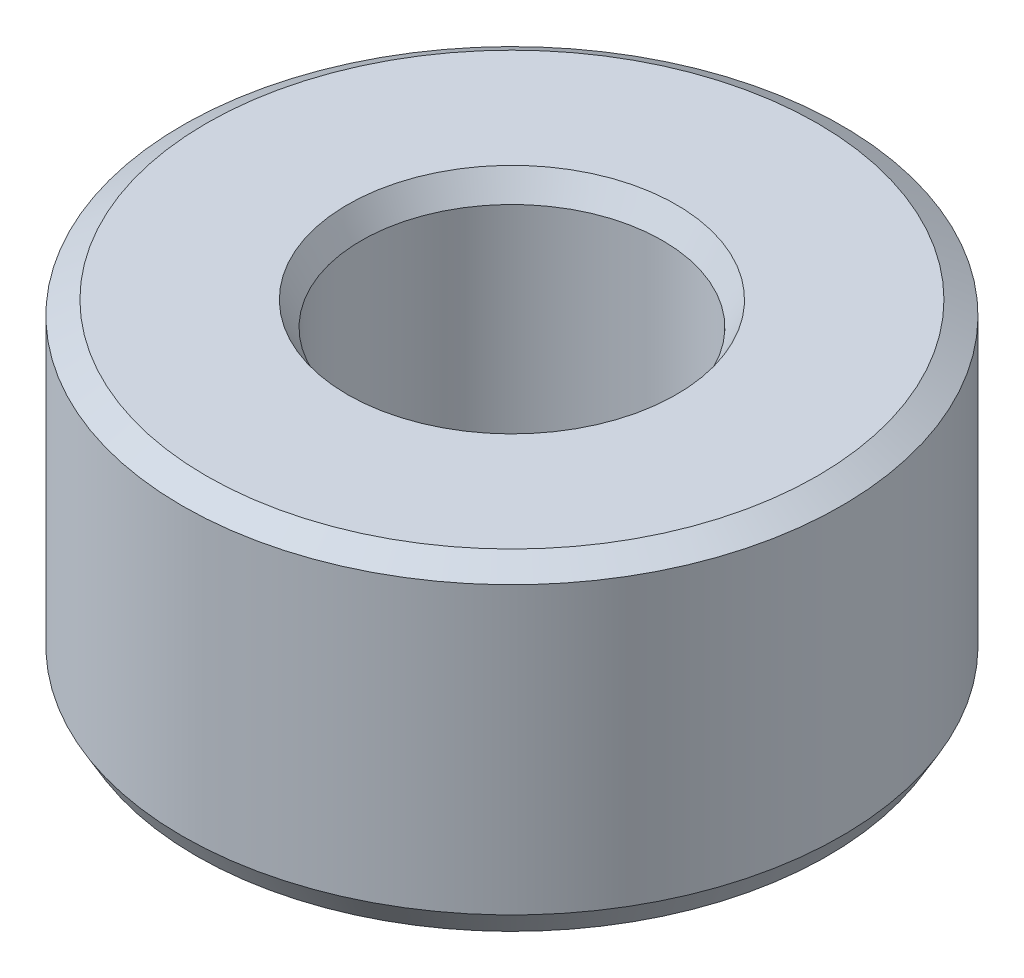
ISO-10303-21;
HEADER;
FILE_DESCRIPTION(('STEP AP214'),'2;1');
FILE_NAME('part.step','',(''),(''),'','','');
FILE_SCHEMA(('AUTOMOTIVE_DESIGN { 1 0 10303 214 1 1 1 1 }'));
ENDSEC;
DATA;
#1=APPLICATION_CONTEXT('core data for automotive mechanical design processes');
#2=APPLICATION_PROTOCOL_DEFINITION('international standard','automotive_design',2000,#1);
#3=PRODUCT_CONTEXT('',#1,'mechanical');
#4=PRODUCT('Part','Part','',(#3));
#5=PRODUCT_RELATED_PRODUCT_CATEGORY('part','',(#4));
#6=PRODUCT_DEFINITION_FORMATION('','',#4);
#7=PRODUCT_DEFINITION_CONTEXT('part definition',#1,'design');
#8=PRODUCT_DEFINITION('design','',#6,#7);
#9=PRODUCT_DEFINITION_SHAPE('','',#8);
#10=(LENGTH_UNIT() NAMED_UNIT(*) SI_UNIT(.MILLI.,.METRE.));
#11=(NAMED_UNIT(*) PLANE_ANGLE_UNIT() SI_UNIT($,.RADIAN.));
#12=(NAMED_UNIT(*) SI_UNIT($,.STERADIAN.) SOLID_ANGLE_UNIT());
#13=UNCERTAINTY_MEASURE_WITH_UNIT(LENGTH_MEASURE(1.E-05),#10,'distance_accuracy_value','');
#14=(GEOMETRIC_REPRESENTATION_CONTEXT(3) GLOBAL_UNCERTAINTY_ASSIGNED_CONTEXT((#13)) GLOBAL_UNIT_ASSIGNED_CONTEXT((#10,
#11,#12)) REPRESENTATION_CONTEXT('',''));
#15=CARTESIAN_POINT('',(0.,0.,0.));
#16=DIRECTION('',(0.,0.,1.));
#17=DIRECTION('',(1.,0.,0.));
#18=AXIS2_PLACEMENT_3D('',#15,#16,#17);
#19=CARTESIAN_POINT('',(0.,9.82928512736957,0.));
#20=DIRECTION('',(0.,-1.,0.));
#21=DIRECTION('',(0.,0.,-1.));
#22=AXIS2_PLACEMENT_3D('',#19,#20,#21);
#23=CYLINDRICAL_SURFACE('',#22,10.);
#24=CARTESIAN_POINT('',(0.,0.730427583920078,0.));
#25=DIRECTION('',(0.,1.,0.));
#26=DIRECTION('',(0.,0.,1.));
#27=AXIS2_PLACEMENT_3D('',#24,#25,#26);
#28=CIRCLE('',#27,10.);
#29=CARTESIAN_POINT('',(0.,0.730427583920078,10.));
#30=VERTEX_POINT('',#29);
#31=EDGE_CURVE('E10',#30,#30,#28,.T.);
#32=ORIENTED_EDGE('',*,*,#31,.T.);
#33=EDGE_LOOP('',(#32));
#34=FACE_BOUND('',#33,.T.);
#35=CARTESIAN_POINT('',(0.,9.40757256516978,0.));
#36=DIRECTION('',(0.,1.,0.));
#37=DIRECTION('',(0.,0.,1.));
#38=AXIS2_PLACEMENT_3D('',#35,#36,#37);
#39=CIRCLE('',#38,10.);
#40=CARTESIAN_POINT('',(0.,9.40757256516978,10.));
#41=VERTEX_POINT('',#40);
#42=EDGE_CURVE('E50',#41,#41,#39,.F.);
#43=ORIENTED_EDGE('',*,*,#42,.T.);
#44=EDGE_LOOP('',(#43));
#45=FACE_BOUND('',#44,.T.);
#46=ADVANCED_FACE('F39',(#34,#45),#23,.T.);
#47=CARTESIAN_POINT('',(0.,9.82928512736957,0.));
#48=DIRECTION('',(0.,1.,0.));
#49=DIRECTION('',(0.,0.,1.));
#50=AXIS2_PLACEMENT_3D('',#47,#48,#49);
#51=PLANE('',#50);
#52=CARTESIAN_POINT('',(0.,9.82928512736957,0.));
#53=DIRECTION('',(0.,1.,0.));
#54=DIRECTION('',(0.,0.,1.));
#55=AXIS2_PLACEMENT_3D('',#52,#53,#54);
#56=CIRCLE('',#55,4.99111512470064);
#57=CARTESIAN_POINT('',(0.,9.82928512736957,4.99111512470064));
#58=VERTEX_POINT('',#57);
#59=EDGE_CURVE('E58',#58,#58,#56,.F.);
#60=ORIENTED_EDGE('',*,*,#59,.T.);
#61=EDGE_LOOP('',(#60));
#62=FACE_BOUND('',#61,.T.);
#63=CARTESIAN_POINT('',(0.,9.82928512736957,0.));
#64=DIRECTION('',(0.,1.,0.));
#65=DIRECTION('',(0.,0.,1.));
#66=AXIS2_PLACEMENT_3D('',#63,#64,#65);
#67=CIRCLE('',#66,9.26957241607992);
#68=CARTESIAN_POINT('',(0.,9.82928512736957,9.26957241607992));
#69=VERTEX_POINT('',#68);
#70=EDGE_CURVE('E61',#69,#69,#67,.T.);
#71=ORIENTED_EDGE('',*,*,#70,.T.);
#72=EDGE_LOOP('',(#71));
#73=FACE_BOUND('',#72,.T.);
#74=ADVANCED_FACE('F88',(#62,#73),#51,.T.);
#75=CARTESIAN_POINT('',(0.,0.,0.));
#76=DIRECTION('',(0.,1.,0.));
#77=DIRECTION('',(0.,0.,1.));
#78=AXIS2_PLACEMENT_3D('',#75,#76,#77);
#79=PLANE('',#78);
#80=CARTESIAN_POINT('',(0.,0.,0.));
#81=DIRECTION('',(0.,1.,0.));
#82=DIRECTION('',(0.,0.,1.));
#83=AXIS2_PLACEMENT_3D('',#80,#81,#82);
#84=CIRCLE('',#83,5.29983014642093);
#85=CARTESIAN_POINT('',(0.,0.,5.29983014642093));
#86=VERTEX_POINT('',#85);
#87=EDGE_CURVE('E51',#86,#86,#84,.T.);
#88=ORIENTED_EDGE('',*,*,#87,.T.);
#89=EDGE_LOOP('',(#88));
#90=FACE_BOUND('',#89,.T.);
#91=CARTESIAN_POINT('',(0.,0.,0.));
#92=DIRECTION('',(0.,1.,0.));
#93=DIRECTION('',(0.,0.,1.));
#94=AXIS2_PLACEMENT_3D('',#91,#92,#93);
#95=CIRCLE('',#94,9.57828743780021);
#96=CARTESIAN_POINT('',(0.,0.,9.57828743780021));
#97=VERTEX_POINT('',#96);
#98=EDGE_CURVE('E54',#97,#97,#95,.F.);
#99=ORIENTED_EDGE('',*,*,#98,.T.);
#100=EDGE_LOOP('',(#99));
#101=FACE_BOUND('',#100,.T.);
#102=ADVANCED_FACE('F83',(#90,#101),#79,.F.);
#103=CARTESIAN_POINT('',(0.,9.82928512736957,0.));
#104=DIRECTION('',(0.,-1.,0.));
#105=DIRECTION('',(0.,0.,-1.));
#106=AXIS2_PLACEMENT_3D('',#103,#104,#105);
#107=CYLINDRICAL_SURFACE('',#106,4.56940256250085);
#108=CARTESIAN_POINT('',(0.,9.0988575434495,0.));
#109=DIRECTION('',(0.,1.,0.));
#110=DIRECTION('',(0.,0.,1.));
#111=AXIS2_PLACEMENT_3D('',#108,#109,#110);
#112=CIRCLE('',#111,4.56940256250085);
#113=CARTESIAN_POINT('',(0.,9.0988575434495,4.56940256250085));
#114=VERTEX_POINT('',#113);
#115=EDGE_CURVE('E67',#114,#114,#112,.T.);
#116=ORIENTED_EDGE('',*,*,#115,.T.);
#117=EDGE_LOOP('',(#116));
#118=FACE_BOUND('',#117,.T.);
#119=CARTESIAN_POINT('',(0.,0.421712562199793,0.));
#120=DIRECTION('',(0.,1.,0.));
#121=DIRECTION('',(0.,0.,1.));
#122=AXIS2_PLACEMENT_3D('',#119,#120,#121);
#123=CIRCLE('',#122,4.56940256250085);
#124=CARTESIAN_POINT('',(0.,0.421712562199793,4.56940256250085));
#125=VERTEX_POINT('',#124);
#126=EDGE_CURVE('E69',#125,#125,#123,.F.);
#127=ORIENTED_EDGE('',*,*,#126,.T.);
#128=EDGE_LOOP('',(#127));
#129=FACE_BOUND('',#128,.T.);
#130=ADVANCED_FACE('F71',(#118,#129),#107,.F.);
#131=CARTESIAN_POINT('',(0.,9.0988575434495,0.));
#132=DIRECTION('',(0.,1.,0.));
#133=DIRECTION('',(0.,0.,1.));
#134=AXIS2_PLACEMENT_3D('',#131,#132,#133);
#135=CONICAL_SURFACE('',#134,4.56940256250085,0.523598775598302);
#136=CARTESIAN_POINT('',(0.,9.82928512736957,4.99111512470064));
#137=CARTESIAN_POINT('',(0.,9.82167650670374,4.98672228551106));
#138=CARTESIAN_POINT('',(0.,9.81406788603791,4.98232944632147));
#139=CARTESIAN_POINT('',(0.,9.79885064470624,4.97354376794231));
#140=CARTESIAN_POINT('',(0.,9.7912420240404,4.96915092875273));
#141=CARTESIAN_POINT('',(0.,9.77602478270874,4.96036525037357));
#142=CARTESIAN_POINT('',(0.,9.7684161620429,4.95597241118399));
#143=CARTESIAN_POINT('',(0.,9.75319892071123,4.94718673280483));
#144=CARTESIAN_POINT('',(0.,9.7455903000454,4.94279389361524));
#145=CARTESIAN_POINT('',(0.,9.73037305871373,4.93400821523608));
#146=CARTESIAN_POINT('',(0.,9.7227644380479,4.9296153760465));
#147=CARTESIAN_POINT('',(0.,9.70754719671623,4.92082969766734));
#148=CARTESIAN_POINT('',(0.,9.69993857605039,4.91643685847776));
#149=CARTESIAN_POINT('',(0.,9.68472133471873,4.9076511800986));
#150=CARTESIAN_POINT('',(0.,9.67711271405289,4.90325834090901));
#151=CARTESIAN_POINT('',(0.,9.66189547272122,4.89447266252985));
#152=CARTESIAN_POINT('',(0.,9.65428685205539,4.89007982334027));
#153=CARTESIAN_POINT('',(0.,9.63906961072372,4.88129414496111));
#154=CARTESIAN_POINT('',(0.,9.63146099005789,4.87690130577153));
#155=CARTESIAN_POINT('',(0.,9.61624374872622,4.86811562739237));
#156=CARTESIAN_POINT('',(0.,9.60863512806039,4.86372278820278));
#157=CARTESIAN_POINT('',(0.,9.59341788672872,4.85493710982362));
#158=CARTESIAN_POINT('',(0.,9.58580926606288,4.85054427063404));
#159=CARTESIAN_POINT('',(0.,9.57059202473121,4.84175859225488));
#160=CARTESIAN_POINT('',(0.,9.56298340406538,4.8373657530653));
#161=CARTESIAN_POINT('',(0.,9.54776616273371,4.82858007468614));
#162=CARTESIAN_POINT('',(0.,9.54015754206788,4.82418723549655));
#163=CARTESIAN_POINT('',(0.,9.52494030073621,4.81540155711739));
#164=CARTESIAN_POINT('',(0.,9.51733168007038,4.81100871792781));
#165=CARTESIAN_POINT('',(0.,9.50211443873871,4.80222303954865));
#166=CARTESIAN_POINT('',(0.,9.49450581807287,4.79783020035907));
#167=CARTESIAN_POINT('',(0.,9.4792885767412,4.78904452197991));
#168=CARTESIAN_POINT('',(0.,9.47167995607537,4.78465168279032));
#169=CARTESIAN_POINT('',(0.,9.4564627147437,4.77586600441116));
#170=CARTESIAN_POINT('',(0.,9.44885409407787,4.77147316522158));
#171=CARTESIAN_POINT('',(0.,9.4336368527462,4.76268748684242));
#172=CARTESIAN_POINT('',(0.,9.42602823208036,4.75829464765284));
#173=CARTESIAN_POINT('',(0.,9.4108109907487,4.74950896927368));
#174=CARTESIAN_POINT('',(0.,9.40320237008286,4.74511613008409));
#175=CARTESIAN_POINT('',(0.,9.3879851287512,4.73633045170493));
#176=CARTESIAN_POINT('',(0.,9.38037650808536,4.73193761251535));
#177=CARTESIAN_POINT('',(0.,9.36515926675369,4.72315193413619));
#178=CARTESIAN_POINT('',(0.,9.35755064608786,4.71875909494661));
#179=CARTESIAN_POINT('',(0.,9.34233340475619,4.70997341656745));
#180=CARTESIAN_POINT('',(0.,9.33472478409036,4.70558057737786));
#181=CARTESIAN_POINT('',(0.,9.31950754275869,4.6967948989987));
#182=CARTESIAN_POINT('',(0.,9.31189892209285,4.69240205980912));
#183=CARTESIAN_POINT('',(0.,9.29668168076119,4.68361638142996));
#184=CARTESIAN_POINT('',(0.,9.28907306009535,4.67922354224038));
#185=CARTESIAN_POINT('',(0.,9.27385581876368,4.67043786386122));
#186=CARTESIAN_POINT('',(0.,9.26624719809785,4.66604502467163));
#187=CARTESIAN_POINT('',(0.,9.25102995676618,4.65725934629247));
#188=CARTESIAN_POINT('',(0.,9.24342133610035,4.65286650710289));
#189=CARTESIAN_POINT('',(0.,9.22820409476868,4.64408082872373));
#190=CARTESIAN_POINT('',(0.,9.22059547410284,4.63968798953415));
#191=CARTESIAN_POINT('',(0.,9.20537823277118,4.63090231115499));
#192=CARTESIAN_POINT('',(0.,9.19776961210534,4.6265094719654));
#193=CARTESIAN_POINT('',(0.,9.18255237077367,4.61772379358624));
#194=CARTESIAN_POINT('',(0.,9.17494375010784,4.61333095439666));
#195=CARTESIAN_POINT('',(0.,9.15972650877617,4.6045452760175));
#196=CARTESIAN_POINT('',(0.,9.15211788811034,4.60015243682792));
#197=CARTESIAN_POINT('',(0.,9.13690064677867,4.59136675844876));
#198=CARTESIAN_POINT('',(0.,9.12929202611283,4.58697391925917));
#199=CARTESIAN_POINT('',(0.,9.11407478478117,4.57818824088001));
#200=CARTESIAN_POINT('',(0.,9.10646616411533,4.57379540169043));
#201=CARTESIAN_POINT('',(0.,9.0988575434495,4.56940256250085));
#202=B_SPLINE_CURVE_WITH_KNOTS('',3,(#136,#137,#138,#139,#140,#141,#142,#143,#144,#145,#146,
#147,#148,#149,#150,#151,#152,#153,#154,#155,#156,#157,#158,#159,#160,#161,#162,#163,#164,#165,
#166,#167,#168,#169,#170,#171,#172,#173,#174,#175,#176,#177,#178,#179,#180,#181,#182,#183,#184,
#185,#186,#187,#188,#189,#190,#191,#192,#193,#194,#195,#196,#197,#198,#199,#200,#201),
.UNSPECIFIED.,.F.,.F.,(4,2,2,2,2,2,2,2,2,2,2,2,2,2,2,2,2,2,2,2,2,2,2,2,2,2,2,2,2,2,2,2,4),(0.,
0.0263570351374878,0.0527140702749737,0.07907110541246,0.105428140549947,0.131785175687433,
0.158142210824921,0.184499245962407,0.210856281099893,0.237213316237381,0.263570351374866,
0.289927386512352,0.31628442164984,0.342641456787326,0.368998491924812,0.3953555270623,
0.421712562199786,0.448069597337271,0.474426632474759,0.500783667612245,0.527140702749731,
0.553497737887219,0.579854773024705,0.606211808162191,0.632568843299678,0.658925878437164,
0.685282913574651,0.711639948712138,0.737996983849624,0.76435401898711,0.790711054124598,
0.817068089262084,0.84342512439957),.UNSPECIFIED.);
#203=EDGE_CURVE('BSEAM77',#58,#114,#202,.T.);
#204=ORIENTED_EDGE('',*,*,#59,.F.);
#205=ORIENTED_EDGE('',*,*,#115,.F.);
#206=ORIENTED_EDGE('',*,*,#203,.T.);
#207=ORIENTED_EDGE('',*,*,#203,.F.);
#208=EDGE_LOOP('',(#204,#206,#205,#207));
#209=FACE_BOUND('',#208,.T.);
#210=ADVANCED_FACE('F77',(#209),#135,.F.);
#211=CARTESIAN_POINT('',(0.,0.,0.));
#212=DIRECTION('',(0.,-1.,0.));
#213=DIRECTION('',(0.,0.,-1.));
#214=AXIS2_PLACEMENT_3D('',#211,#212,#213);
#215=CONICAL_SURFACE('',#214,5.29983014642093,1.04719755119659);
#216=ORIENTED_EDGE('',*,*,#126,.F.);
#217=EDGE_LOOP('',(#216));
#218=FACE_BOUND('',#217,.T.);
#219=ORIENTED_EDGE('',*,*,#87,.F.);
#220=EDGE_LOOP('',(#219));
#221=FACE_BOUND('',#220,.T.);
#222=ADVANCED_FACE('F73',(#218,#221),#215,.F.);
#223=CARTESIAN_POINT('',(0.,0.730427583920078,0.));
#224=DIRECTION('',(0.,1.,0.));
#225=DIRECTION('',(0.,0.,1.));
#226=AXIS2_PLACEMENT_3D('',#223,#224,#225);
#227=CONICAL_SURFACE('',#226,10.,0.523598775598302);
#228=ORIENTED_EDGE('',*,*,#98,.F.);
#229=EDGE_LOOP('',(#228));
#230=FACE_BOUND('',#229,.T.);
#231=ORIENTED_EDGE('',*,*,#31,.F.);
#232=EDGE_LOOP('',(#231));
#233=FACE_BOUND('',#232,.T.);
#234=ADVANCED_FACE('F76',(#230,#233),#227,.T.);
#235=CARTESIAN_POINT('',(0.,9.82928512736957,0.));
#236=DIRECTION('',(0.,-1.,0.));
#237=DIRECTION('',(0.,0.,-1.));
#238=AXIS2_PLACEMENT_3D('',#235,#236,#237);
#239=CONICAL_SURFACE('',#238,9.26957241607992,1.04719755119659);
#240=ORIENTED_EDGE('',*,*,#42,.F.);
#241=EDGE_LOOP('',(#240));
#242=FACE_BOUND('',#241,.T.);
#243=ORIENTED_EDGE('',*,*,#70,.F.);
#244=EDGE_LOOP('',(#243));
#245=FACE_BOUND('',#244,.T.);
#246=ADVANCED_FACE('F45',(#242,#245),#239,.T.);
#247=CLOSED_SHELL('',(#46,#74,#102,#130,#210,#222,#234,#246));
#248=MANIFOLD_SOLID_BREP('B2',#247);
#249=ADVANCED_BREP_SHAPE_REPRESENTATION('',(#18,#248),#14);
#250=SHAPE_DEFINITION_REPRESENTATION(#9,#249);
ENDSEC;
END-ISO-10303-21;
